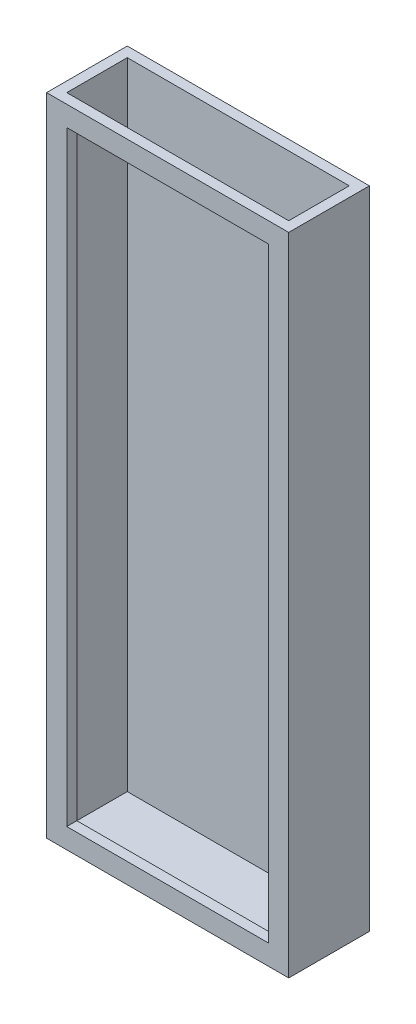
ISO-10303-21;
HEADER;
FILE_DESCRIPTION(('STEP AP214'),'2;1');
FILE_NAME('part.step','',(''),(''),'','','');
FILE_SCHEMA(('AUTOMOTIVE_DESIGN { 1 0 10303 214 1 1 1 1 }'));
ENDSEC;
DATA;
#1=APPLICATION_CONTEXT('core data for automotive mechanical design processes');
#2=APPLICATION_PROTOCOL_DEFINITION('international standard','automotive_design',2000,#1);
#3=PRODUCT_CONTEXT('',#1,'mechanical');
#4=PRODUCT('Part','Part','',(#3));
#5=PRODUCT_RELATED_PRODUCT_CATEGORY('part','',(#4));
#6=PRODUCT_DEFINITION_FORMATION('','',#4);
#7=PRODUCT_DEFINITION_CONTEXT('part definition',#1,'design');
#8=PRODUCT_DEFINITION('design','',#6,#7);
#9=PRODUCT_DEFINITION_SHAPE('','',#8);
#10=(LENGTH_UNIT() NAMED_UNIT(*) SI_UNIT(.MILLI.,.METRE.));
#11=(NAMED_UNIT(*) PLANE_ANGLE_UNIT() SI_UNIT($,.RADIAN.));
#12=(NAMED_UNIT(*) SI_UNIT($,.STERADIAN.) SOLID_ANGLE_UNIT());
#13=UNCERTAINTY_MEASURE_WITH_UNIT(LENGTH_MEASURE(1.E-05),#10,'distance_accuracy_value','');
#14=(GEOMETRIC_REPRESENTATION_CONTEXT(3) GLOBAL_UNCERTAINTY_ASSIGNED_CONTEXT((#13)) GLOBAL_UNIT_ASSIGNED_CONTEXT((#10,
#11,#12)) REPRESENTATION_CONTEXT('',''));
#15=CARTESIAN_POINT('',(0.,0.,0.));
#16=DIRECTION('',(0.,0.,1.));
#17=DIRECTION('',(1.,0.,0.));
#18=AXIS2_PLACEMENT_3D('',#15,#16,#17);
#19=CARTESIAN_POINT('',(38.1,203.2,-12.7));
#20=DIRECTION('',(-1.,0.,0.));
#21=DIRECTION('',(0.,0.,1.));
#22=AXIS2_PLACEMENT_3D('',#19,#20,#21);
#23=PLANE('',#22);
#24=DIRECTION('',(0.,0.,-1.));
#25=VECTOR('',#24,1.);
#26=CARTESIAN_POINT('',(38.1,0.,-12.7));
#27=LINE('',#26,#25);
#28=CARTESIAN_POINT('',(38.1,0.,12.7));
#29=VERTEX_POINT('',#28);
#30=CARTESIAN_POINT('',(38.1,0.,-12.7));
#31=VERTEX_POINT('',#30);
#32=EDGE_CURVE('E187',#29,#31,#27,.T.);
#33=ORIENTED_EDGE('',*,*,#32,.T.);
#34=DIRECTION('',(0.,-1.,0.));
#35=VECTOR('',#34,1.);
#36=CARTESIAN_POINT('',(38.1,203.2,-12.7));
#37=LINE('',#36,#35);
#38=CARTESIAN_POINT('',(38.1,203.2,-12.7));
#39=VERTEX_POINT('',#38);
#40=EDGE_CURVE('E220',#39,#31,#37,.T.);
#41=ORIENTED_EDGE('',*,*,#40,.F.);
#42=DIRECTION('',(0.,0.,-1.));
#43=VECTOR('',#42,1.);
#44=CARTESIAN_POINT('',(38.1,203.2,-12.7));
#45=LINE('',#44,#43);
#46=CARTESIAN_POINT('',(38.1,203.2,12.7));
#47=VERTEX_POINT('',#46);
#48=EDGE_CURVE('E194',#47,#39,#45,.T.);
#49=ORIENTED_EDGE('',*,*,#48,.F.);
#50=DIRECTION('',(0.,-1.,0.));
#51=VECTOR('',#50,1.);
#52=CARTESIAN_POINT('',(38.1,203.2,12.7));
#53=LINE('',#52,#51);
#54=EDGE_CURVE('E204',#47,#29,#53,.T.);
#55=ORIENTED_EDGE('',*,*,#54,.T.);
#56=EDGE_LOOP('',(#33,#41,#49,#55));
#57=FACE_BOUND('',#56,.T.);
#58=ADVANCED_FACE('F45',(#57),#23,.F.);
#59=CARTESIAN_POINT('',(-38.1,203.2,-12.7));
#60=DIRECTION('',(0.,0.,1.));
#61=DIRECTION('',(1.,0.,0.));
#62=AXIS2_PLACEMENT_3D('',#59,#60,#61);
#63=PLANE('',#62);
#64=DIRECTION('',(-1.,0.,0.));
#65=VECTOR('',#64,1.);
#66=CARTESIAN_POINT('',(-38.1,0.,-12.7));
#67=LINE('',#66,#65);
#68=CARTESIAN_POINT('',(-38.1,0.,-12.7));
#69=VERTEX_POINT('',#68);
#70=EDGE_CURVE('E207',#31,#69,#67,.T.);
#71=ORIENTED_EDGE('',*,*,#70,.T.);
#72=DIRECTION('',(0.,-1.,0.));
#73=VECTOR('',#72,1.);
#74=CARTESIAN_POINT('',(-38.1,203.2,-12.7));
#75=LINE('',#74,#73);
#76=CARTESIAN_POINT('',(-38.1,203.2,-12.7));
#77=VERTEX_POINT('',#76);
#78=EDGE_CURVE('E217',#77,#69,#75,.T.);
#79=ORIENTED_EDGE('',*,*,#78,.F.);
#80=DIRECTION('',(-1.,0.,0.));
#81=VECTOR('',#80,1.);
#82=CARTESIAN_POINT('',(-38.1,203.2,-12.7));
#83=LINE('',#82,#81);
#84=EDGE_CURVE('E197',#39,#77,#83,.T.);
#85=ORIENTED_EDGE('',*,*,#84,.F.);
#86=ORIENTED_EDGE('',*,*,#40,.T.);
#87=EDGE_LOOP('',(#71,#79,#85,#86));
#88=FACE_BOUND('',#87,.T.);
#89=ADVANCED_FACE('F247',(#88),#63,.F.);
#90=CARTESIAN_POINT('',(-38.1,203.2,-12.7));
#91=DIRECTION('',(1.,0.,0.));
#92=DIRECTION('',(0.,0.,-1.));
#93=AXIS2_PLACEMENT_3D('',#90,#91,#92);
#94=PLANE('',#93);
#95=DIRECTION('',(0.,0.,1.));
#96=VECTOR('',#95,1.);
#97=CARTESIAN_POINT('',(-38.1,0.,-12.7));
#98=LINE('',#97,#96);
#99=CARTESIAN_POINT('',(-38.1,0.,12.7));
#100=VERTEX_POINT('',#99);
#101=EDGE_CURVE('E209',#69,#100,#98,.T.);
#102=ORIENTED_EDGE('',*,*,#101,.T.);
#103=DIRECTION('',(0.,-1.,0.));
#104=VECTOR('',#103,1.);
#105=CARTESIAN_POINT('',(-38.1,203.2,12.7));
#106=LINE('',#105,#104);
#107=CARTESIAN_POINT('',(-38.1,203.2,12.7));
#108=VERTEX_POINT('',#107);
#109=EDGE_CURVE('E214',#108,#100,#106,.T.);
#110=ORIENTED_EDGE('',*,*,#109,.F.);
#111=DIRECTION('',(0.,0.,1.));
#112=VECTOR('',#111,1.);
#113=CARTESIAN_POINT('',(-38.1,203.2,-12.7));
#114=LINE('',#113,#112);
#115=EDGE_CURVE('E200',#77,#108,#114,.T.);
#116=ORIENTED_EDGE('',*,*,#115,.F.);
#117=ORIENTED_EDGE('',*,*,#78,.T.);
#118=EDGE_LOOP('',(#102,#110,#116,#117));
#119=FACE_BOUND('',#118,.T.);
#120=ADVANCED_FACE('F252',(#119),#94,.F.);
#121=CARTESIAN_POINT('',(-38.1,203.2,12.7));
#122=DIRECTION('',(0.,0.,-1.));
#123=DIRECTION('',(-1.,0.,0.));
#124=AXIS2_PLACEMENT_3D('',#121,#122,#123);
#125=PLANE('',#124);
#126=DIRECTION('',(-1.,0.,0.));
#127=VECTOR('',#126,1.);
#128=CARTESIAN_POINT('',(-31.75,196.85,12.7));
#129=LINE('',#128,#127);
#130=CARTESIAN_POINT('',(31.75,196.85,12.7));
#131=VERTEX_POINT('',#130);
#132=CARTESIAN_POINT('',(-31.75,196.85,12.7));
#133=VERTEX_POINT('',#132);
#134=EDGE_CURVE('E145',#131,#133,#129,.T.);
#135=ORIENTED_EDGE('',*,*,#134,.F.);
#136=DIRECTION('',(0.,1.,0.));
#137=VECTOR('',#136,1.);
#138=CARTESIAN_POINT('',(31.75,196.85,12.7));
#139=LINE('',#138,#137);
#140=CARTESIAN_POINT('',(31.75,6.35,12.7));
#141=VERTEX_POINT('',#140);
#142=EDGE_CURVE('E59',#141,#131,#139,.T.);
#143=ORIENTED_EDGE('',*,*,#142,.F.);
#144=DIRECTION('',(1.,0.,0.));
#145=VECTOR('',#144,1.);
#146=CARTESIAN_POINT('',(-31.75,6.35,12.7));
#147=LINE('',#146,#145);
#148=CARTESIAN_POINT('',(-31.75,6.35,12.7));
#149=VERTEX_POINT('',#148);
#150=EDGE_CURVE('E152',#149,#141,#147,.T.);
#151=ORIENTED_EDGE('',*,*,#150,.F.);
#152=DIRECTION('',(0.,-1.,0.));
#153=VECTOR('',#152,1.);
#154=CARTESIAN_POINT('',(-31.75,196.85,12.7));
#155=LINE('',#154,#153);
#156=EDGE_CURVE('E136',#133,#149,#155,.T.);
#157=ORIENTED_EDGE('',*,*,#156,.F.);
#158=EDGE_LOOP('',(#135,#143,#151,#157));
#159=FACE_BOUND('',#158,.T.);
#160=DIRECTION('',(1.,0.,0.));
#161=VECTOR('',#160,1.);
#162=CARTESIAN_POINT('',(-38.1,0.,12.7));
#163=LINE('',#162,#161);
#164=EDGE_CURVE('E198',#100,#29,#163,.T.);
#165=ORIENTED_EDGE('',*,*,#164,.T.);
#166=ORIENTED_EDGE('',*,*,#54,.F.);
#167=DIRECTION('',(1.,0.,0.));
#168=VECTOR('',#167,1.);
#169=CARTESIAN_POINT('',(-38.1,203.2,12.7));
#170=LINE('',#169,#168);
#171=EDGE_CURVE('E202',#108,#47,#170,.T.);
#172=ORIENTED_EDGE('',*,*,#171,.F.);
#173=ORIENTED_EDGE('',*,*,#109,.T.);
#174=EDGE_LOOP('',(#165,#166,#172,#173));
#175=FACE_BOUND('',#174,.T.);
#176=ADVANCED_FACE('F149',(#159,#175),#125,.F.);
#177=CARTESIAN_POINT('',(0.,203.2,0.));
#178=DIRECTION('',(0.,1.,0.));
#179=DIRECTION('',(0.,0.,1.));
#180=AXIS2_PLACEMENT_3D('',#177,#178,#179);
#181=PLANE('',#180);
#182=DIRECTION('',(0.,0.,-1.));
#183=VECTOR('',#182,1.);
#184=CARTESIAN_POINT('',(34.925,203.2,-9.525));
#185=LINE('',#184,#183);
#186=CARTESIAN_POINT('',(34.925,203.2,9.525));
#187=VERTEX_POINT('',#186);
#188=CARTESIAN_POINT('',(34.925,203.2,-9.525));
#189=VERTEX_POINT('',#188);
#190=EDGE_CURVE('E159',#187,#189,#185,.T.);
#191=ORIENTED_EDGE('',*,*,#190,.F.);
#192=DIRECTION('',(1.,0.,0.));
#193=VECTOR('',#192,1.);
#194=CARTESIAN_POINT('',(-34.925,203.2,9.525));
#195=LINE('',#194,#193);
#196=CARTESIAN_POINT('',(-34.925,203.2,9.525));
#197=VERTEX_POINT('',#196);
#198=EDGE_CURVE('E166',#197,#187,#195,.T.);
#199=ORIENTED_EDGE('',*,*,#198,.F.);
#200=DIRECTION('',(0.,0.,1.));
#201=VECTOR('',#200,1.);
#202=CARTESIAN_POINT('',(-34.925,203.2,-9.525));
#203=LINE('',#202,#201);
#204=CARTESIAN_POINT('',(-34.925,203.2,-9.525));
#205=VERTEX_POINT('',#204);
#206=EDGE_CURVE('E180',#205,#197,#203,.T.);
#207=ORIENTED_EDGE('',*,*,#206,.F.);
#208=DIRECTION('',(-1.,0.,0.));
#209=VECTOR('',#208,1.);
#210=CARTESIAN_POINT('',(-34.925,203.2,-9.525));
#211=LINE('',#210,#209);
#212=EDGE_CURVE('E177',#189,#205,#211,.T.);
#213=ORIENTED_EDGE('',*,*,#212,.F.);
#214=EDGE_LOOP('',(#191,#199,#207,#213));
#215=FACE_BOUND('',#214,.T.);
#216=ORIENTED_EDGE('',*,*,#48,.T.);
#217=ORIENTED_EDGE('',*,*,#84,.T.);
#218=ORIENTED_EDGE('',*,*,#115,.T.);
#219=ORIENTED_EDGE('',*,*,#171,.T.);
#220=EDGE_LOOP('',(#216,#217,#218,#219));
#221=FACE_BOUND('',#220,.T.);
#222=ADVANCED_FACE('F265',(#215,#221),#181,.T.);
#223=CARTESIAN_POINT('',(0.,0.,0.));
#224=DIRECTION('',(0.,1.,0.));
#225=DIRECTION('',(0.,0.,1.));
#226=AXIS2_PLACEMENT_3D('',#223,#224,#225);
#227=PLANE('',#226);
#228=ORIENTED_EDGE('',*,*,#32,.F.);
#229=ORIENTED_EDGE('',*,*,#164,.F.);
#230=ORIENTED_EDGE('',*,*,#101,.F.);
#231=ORIENTED_EDGE('',*,*,#70,.F.);
#232=EDGE_LOOP('',(#228,#229,#230,#231));
#233=FACE_BOUND('',#232,.T.);
#234=ADVANCED_FACE('F260',(#233),#227,.F.);
#235=CARTESIAN_POINT('',(34.925,3.17500000000001,-9.525));
#236=DIRECTION('',(1.,0.,0.));
#237=DIRECTION('',(0.,0.,-1.));
#238=AXIS2_PLACEMENT_3D('',#235,#236,#237);
#239=PLANE('',#238);
#240=ORIENTED_EDGE('',*,*,#190,.T.);
#241=DIRECTION('',(0.,1.,0.));
#242=VECTOR('',#241,1.);
#243=CARTESIAN_POINT('',(34.925,3.17500000000001,-9.525));
#244=LINE('',#243,#242);
#245=CARTESIAN_POINT('',(34.925,3.17500000000001,-9.525));
#246=VERTEX_POINT('',#245);
#247=EDGE_CURVE('E175',#246,#189,#244,.T.);
#248=ORIENTED_EDGE('',*,*,#247,.F.);
#249=DIRECTION('',(0.,0.,-1.));
#250=VECTOR('',#249,1.);
#251=CARTESIAN_POINT('',(34.925,3.17500000000001,-9.525));
#252=LINE('',#251,#250);
#253=CARTESIAN_POINT('',(34.925,3.17500000000001,9.525));
#254=VERTEX_POINT('',#253);
#255=EDGE_CURVE('E162',#254,#246,#252,.T.);
#256=ORIENTED_EDGE('',*,*,#255,.F.);
#257=DIRECTION('',(0.,1.,0.));
#258=VECTOR('',#257,1.);
#259=CARTESIAN_POINT('',(34.925,3.17500000000001,9.525));
#260=LINE('',#259,#258);
#261=EDGE_CURVE('E185',#254,#187,#260,.T.);
#262=ORIENTED_EDGE('',*,*,#261,.T.);
#263=EDGE_LOOP('',(#240,#248,#256,#262));
#264=FACE_BOUND('',#263,.T.);
#265=ADVANCED_FACE('F278',(#264),#239,.F.);
#266=CARTESIAN_POINT('',(-34.925,3.17500000000001,9.525));
#267=DIRECTION('',(0.,0.,1.));
#268=DIRECTION('',(1.,0.,0.));
#269=AXIS2_PLACEMENT_3D('',#266,#267,#268);
#270=PLANE('',#269);
#271=DIRECTION('',(1.,0.,0.));
#272=VECTOR('',#271,1.);
#273=CARTESIAN_POINT('',(-34.925,6.35,9.525));
#274=LINE('',#273,#272);
#275=CARTESIAN_POINT('',(-31.75,6.35,9.525));
#276=VERTEX_POINT('',#275);
#277=CARTESIAN_POINT('',(31.75,6.35,9.525));
#278=VERTEX_POINT('',#277);
#279=EDGE_CURVE('E52',#276,#278,#274,.T.);
#280=ORIENTED_EDGE('',*,*,#279,.T.);
#281=DIRECTION('',(0.,1.,0.));
#282=VECTOR('',#281,1.);
#283=CARTESIAN_POINT('',(31.75,3.17500000000002,9.525));
#284=LINE('',#283,#282);
#285=CARTESIAN_POINT('',(31.75,196.85,9.525));
#286=VERTEX_POINT('',#285);
#287=EDGE_CURVE('E11',#278,#286,#284,.T.);
#288=ORIENTED_EDGE('',*,*,#287,.T.);
#289=DIRECTION('',(-1.,0.,0.));
#290=VECTOR('',#289,1.);
#291=CARTESIAN_POINT('',(-34.925,196.85,9.525));
#292=LINE('',#291,#290);
#293=CARTESIAN_POINT('',(-31.75,196.85,9.525));
#294=VERTEX_POINT('',#293);
#295=EDGE_CURVE('E223',#286,#294,#292,.T.);
#296=ORIENTED_EDGE('',*,*,#295,.T.);
#297=DIRECTION('',(0.,-1.,0.));
#298=VECTOR('',#297,1.);
#299=CARTESIAN_POINT('',(-31.75,3.17500000000001,9.525));
#300=LINE('',#299,#298);
#301=EDGE_CURVE('E139',#294,#276,#300,.T.);
#302=ORIENTED_EDGE('',*,*,#301,.T.);
#303=EDGE_LOOP('',(#280,#288,#296,#302));
#304=FACE_BOUND('',#303,.T.);
#305=ORIENTED_EDGE('',*,*,#198,.T.);
#306=ORIENTED_EDGE('',*,*,#261,.F.);
#307=DIRECTION('',(1.,0.,0.));
#308=VECTOR('',#307,1.);
#309=CARTESIAN_POINT('',(-34.925,3.17500000000001,9.525));
#310=LINE('',#309,#308);
#311=CARTESIAN_POINT('',(-34.925,3.17500000000001,9.525));
#312=VERTEX_POINT('',#311);
#313=EDGE_CURVE('E172',#312,#254,#310,.T.);
#314=ORIENTED_EDGE('',*,*,#313,.F.);
#315=DIRECTION('',(0.,1.,0.));
#316=VECTOR('',#315,1.);
#317=CARTESIAN_POINT('',(-34.925,3.17500000000001,9.525));
#318=LINE('',#317,#316);
#319=EDGE_CURVE('E188',#312,#197,#318,.T.);
#320=ORIENTED_EDGE('',*,*,#319,.T.);
#321=EDGE_LOOP('',(#305,#306,#314,#320));
#322=FACE_BOUND('',#321,.T.);
#323=ADVANCED_FACE('F227',(#304,#322),#270,.F.);
#324=CARTESIAN_POINT('',(-34.925,3.17500000000001,-9.525));
#325=DIRECTION('',(-1.,0.,0.));
#326=DIRECTION('',(0.,0.,1.));
#327=AXIS2_PLACEMENT_3D('',#324,#325,#326);
#328=PLANE('',#327);
#329=ORIENTED_EDGE('',*,*,#206,.T.);
#330=ORIENTED_EDGE('',*,*,#319,.F.);
#331=DIRECTION('',(0.,0.,1.));
#332=VECTOR('',#331,1.);
#333=CARTESIAN_POINT('',(-34.925,3.17500000000001,-9.525));
#334=LINE('',#333,#332);
#335=CARTESIAN_POINT('',(-34.925,3.17500000000001,-9.525));
#336=VERTEX_POINT('',#335);
#337=EDGE_CURVE('E169',#336,#312,#334,.T.);
#338=ORIENTED_EDGE('',*,*,#337,.F.);
#339=DIRECTION('',(0.,1.,0.));
#340=VECTOR('',#339,1.);
#341=CARTESIAN_POINT('',(-34.925,3.17500000000001,-9.525));
#342=LINE('',#341,#340);
#343=EDGE_CURVE('E190',#336,#205,#342,.T.);
#344=ORIENTED_EDGE('',*,*,#343,.T.);
#345=EDGE_LOOP('',(#329,#330,#338,#344));
#346=FACE_BOUND('',#345,.T.);
#347=ADVANCED_FACE('F287',(#346),#328,.F.);
#348=CARTESIAN_POINT('',(-34.925,3.17500000000001,-9.525));
#349=DIRECTION('',(0.,0.,-1.));
#350=DIRECTION('',(-1.,0.,0.));
#351=AXIS2_PLACEMENT_3D('',#348,#349,#350);
#352=PLANE('',#351);
#353=ORIENTED_EDGE('',*,*,#212,.T.);
#354=ORIENTED_EDGE('',*,*,#343,.F.);
#355=DIRECTION('',(-1.,0.,0.));
#356=VECTOR('',#355,1.);
#357=CARTESIAN_POINT('',(-34.925,3.17500000000001,-9.525));
#358=LINE('',#357,#356);
#359=EDGE_CURVE('E165',#246,#336,#358,.T.);
#360=ORIENTED_EDGE('',*,*,#359,.F.);
#361=ORIENTED_EDGE('',*,*,#247,.T.);
#362=EDGE_LOOP('',(#353,#354,#360,#361));
#363=FACE_BOUND('',#362,.T.);
#364=ADVANCED_FACE('F242',(#363),#352,.F.);
#365=CARTESIAN_POINT('',(0.,3.17500000000001,0.));
#366=DIRECTION('',(0.,1.,0.));
#367=DIRECTION('',(0.,0.,1.));
#368=AXIS2_PLACEMENT_3D('',#365,#366,#367);
#369=PLANE('',#368);
#370=ORIENTED_EDGE('',*,*,#255,.T.);
#371=ORIENTED_EDGE('',*,*,#359,.T.);
#372=ORIENTED_EDGE('',*,*,#337,.T.);
#373=ORIENTED_EDGE('',*,*,#313,.T.);
#374=EDGE_LOOP('',(#370,#371,#372,#373));
#375=FACE_BOUND('',#374,.T.);
#376=ADVANCED_FACE('F234',(#375),#369,.T.);
#377=CARTESIAN_POINT('',(31.75,196.85,3.81));
#378=DIRECTION('',(1.,0.,0.));
#379=DIRECTION('',(0.,1.,0.));
#380=AXIS2_PLACEMENT_3D('',#377,#378,#379);
#381=PLANE('',#380);
#382=DIRECTION('',(0.,0.,1.));
#383=VECTOR('',#382,1.);
#384=CARTESIAN_POINT('',(31.75,6.35,3.81));
#385=LINE('',#384,#383);
#386=EDGE_CURVE('E157',#278,#141,#385,.T.);
#387=ORIENTED_EDGE('',*,*,#386,.T.);
#388=ORIENTED_EDGE('',*,*,#142,.T.);
#389=DIRECTION('',(0.,0.,1.));
#390=VECTOR('',#389,1.);
#391=CARTESIAN_POINT('',(31.75,196.85,3.81));
#392=LINE('',#391,#390);
#393=EDGE_CURVE('E142',#286,#131,#392,.T.);
#394=ORIENTED_EDGE('',*,*,#393,.F.);
#395=ORIENTED_EDGE('',*,*,#287,.F.);
#396=EDGE_LOOP('',(#387,#388,#394,#395));
#397=FACE_BOUND('',#396,.T.);
#398=ADVANCED_FACE('F232',(#397),#381,.F.);
#399=CARTESIAN_POINT('',(-31.75,6.35,3.81));
#400=DIRECTION('',(0.,-1.,0.));
#401=DIRECTION('',(0.,0.,-1.));
#402=AXIS2_PLACEMENT_3D('',#399,#400,#401);
#403=PLANE('',#402);
#404=DIRECTION('',(0.,0.,1.));
#405=VECTOR('',#404,1.);
#406=CARTESIAN_POINT('',(-31.75,6.35,3.81));
#407=LINE('',#406,#405);
#408=EDGE_CURVE('E141',#276,#149,#407,.T.);
#409=ORIENTED_EDGE('',*,*,#408,.T.);
#410=ORIENTED_EDGE('',*,*,#150,.T.);
#411=ORIENTED_EDGE('',*,*,#386,.F.);
#412=ORIENTED_EDGE('',*,*,#279,.F.);
#413=EDGE_LOOP('',(#409,#410,#411,#412));
#414=FACE_BOUND('',#413,.T.);
#415=ADVANCED_FACE('F231',(#414),#403,.F.);
#416=CARTESIAN_POINT('',(-31.75,196.85,3.81));
#417=DIRECTION('',(-1.,0.,0.));
#418=DIRECTION('',(0.,-1.,0.));
#419=AXIS2_PLACEMENT_3D('',#416,#417,#418);
#420=PLANE('',#419);
#421=DIRECTION('',(0.,0.,1.));
#422=VECTOR('',#421,1.);
#423=CARTESIAN_POINT('',(-31.75,196.85,3.81));
#424=LINE('',#423,#422);
#425=EDGE_CURVE('E67',#294,#133,#424,.T.);
#426=ORIENTED_EDGE('',*,*,#425,.T.);
#427=ORIENTED_EDGE('',*,*,#156,.T.);
#428=ORIENTED_EDGE('',*,*,#408,.F.);
#429=ORIENTED_EDGE('',*,*,#301,.F.);
#430=EDGE_LOOP('',(#426,#427,#428,#429));
#431=FACE_BOUND('',#430,.T.);
#432=ADVANCED_FACE('F133',(#431),#420,.F.);
#433=CARTESIAN_POINT('',(-31.75,196.85,3.81));
#434=DIRECTION('',(0.,1.,0.));
#435=DIRECTION('',(0.,0.,1.));
#436=AXIS2_PLACEMENT_3D('',#433,#434,#435);
#437=PLANE('',#436);
#438=ORIENTED_EDGE('',*,*,#393,.T.);
#439=ORIENTED_EDGE('',*,*,#134,.T.);
#440=ORIENTED_EDGE('',*,*,#425,.F.);
#441=ORIENTED_EDGE('',*,*,#295,.F.);
#442=EDGE_LOOP('',(#438,#439,#440,#441));
#443=FACE_BOUND('',#442,.T.);
#444=ADVANCED_FACE('F146',(#443),#437,.F.);
#445=CLOSED_SHELL('',(#58,#89,#120,#176,#222,#234,#265,#323,#347,#364,#376,#398,#415,#432,#444));
#446=MANIFOLD_SOLID_BREP('B2',#445);
#447=ADVANCED_BREP_SHAPE_REPRESENTATION('',(#18,#446),#14);
#448=SHAPE_DEFINITION_REPRESENTATION(#9,#447);
ENDSEC;
END-ISO-10303-21;
